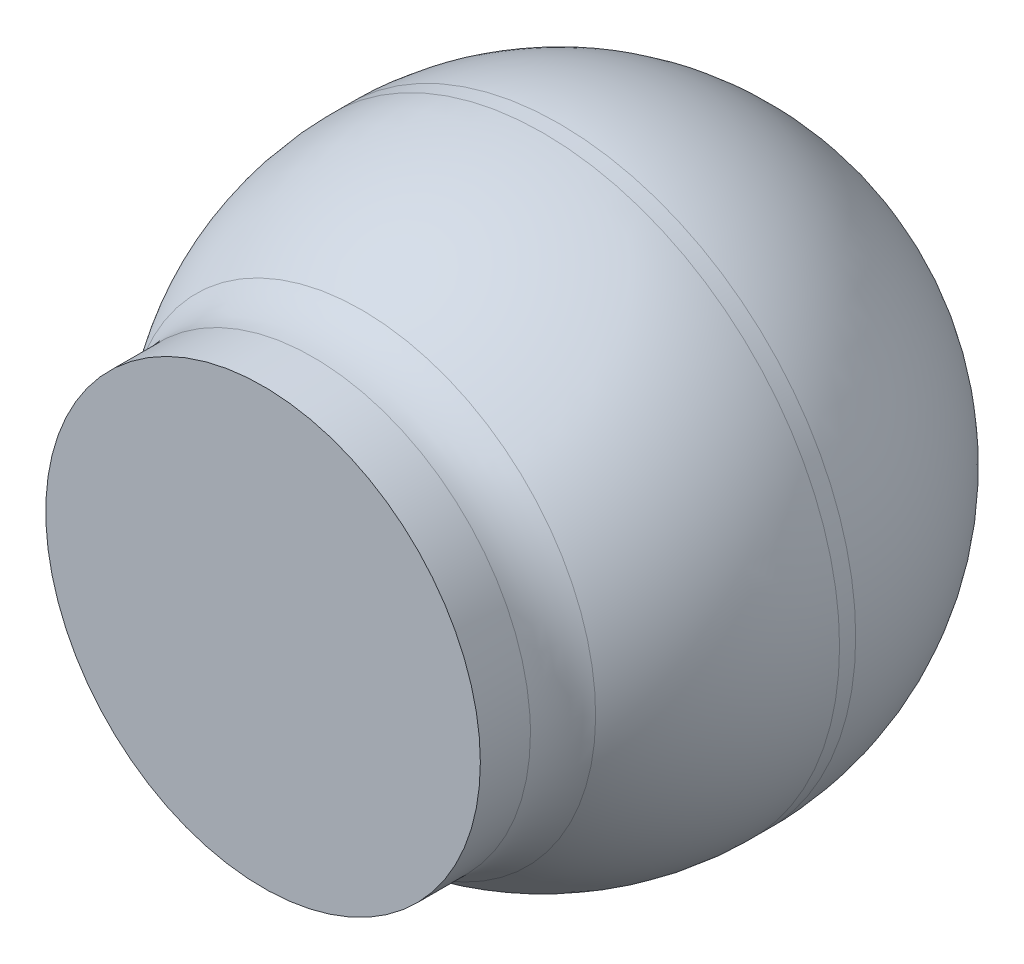
ISO-10303-21;
HEADER;
FILE_DESCRIPTION(('STEP AP214'),'2;1');
FILE_NAME('part.step','',(''),(''),'','','');
FILE_SCHEMA(('AUTOMOTIVE_DESIGN { 1 0 10303 214 1 1 1 1 }'));
ENDSEC;
DATA;
#1=APPLICATION_CONTEXT('core data for automotive mechanical design processes');
#2=APPLICATION_PROTOCOL_DEFINITION('international standard','automotive_design',2000,#1);
#3=PRODUCT_CONTEXT('',#1,'mechanical');
#4=PRODUCT('Part','Part','',(#3));
#5=PRODUCT_RELATED_PRODUCT_CATEGORY('part','',(#4));
#6=PRODUCT_DEFINITION_FORMATION('','',#4);
#7=PRODUCT_DEFINITION_CONTEXT('part definition',#1,'design');
#8=PRODUCT_DEFINITION('design','',#6,#7);
#9=PRODUCT_DEFINITION_SHAPE('','',#8);
#10=(LENGTH_UNIT() NAMED_UNIT(*) SI_UNIT(.MILLI.,.METRE.));
#11=(NAMED_UNIT(*) PLANE_ANGLE_UNIT() SI_UNIT($,.RADIAN.));
#12=(NAMED_UNIT(*) SI_UNIT($,.STERADIAN.) SOLID_ANGLE_UNIT());
#13=UNCERTAINTY_MEASURE_WITH_UNIT(LENGTH_MEASURE(1.E-05),#10,'distance_accuracy_value','');
#14=(GEOMETRIC_REPRESENTATION_CONTEXT(3) GLOBAL_UNCERTAINTY_ASSIGNED_CONTEXT((#13)) GLOBAL_UNIT_ASSIGNED_CONTEXT((#10,
#11,#12)) REPRESENTATION_CONTEXT('',''));
#15=CARTESIAN_POINT('',(0.,0.,0.));
#16=DIRECTION('',(0.,0.,1.));
#17=DIRECTION('',(1.,0.,0.));
#18=AXIS2_PLACEMENT_3D('',#15,#16,#17);
#19=CARTESIAN_POINT('',(-6.912919922269,-2.781349291452,10.006534503384));
#20=DIRECTION('',(0.,0.,-1.));
#21=DIRECTION('',(-1.,0.,0.));
#22=AXIS2_PLACEMENT_3D('',#19,#20,#21);
#23=PLANE('',#22);
#24=CARTESIAN_POINT('',(-6.912919922269,-2.781349291452,10.006534503384));
#25=DIRECTION('',(0.,0.,1.));
#26=DIRECTION('',(1.,0.,0.));
#27=AXIS2_PLACEMENT_3D('',#24,#25,#26);
#28=CIRCLE('',#27,0.275);
#29=CARTESIAN_POINT('',(-6.637919922269,-2.781349291452,10.006534503384));
#30=VERTEX_POINT('',#29);
#31=EDGE_CURVE('E20',#30,#30,#28,.F.);
#32=ORIENTED_EDGE('',*,*,#31,.F.);
#33=EDGE_LOOP('',(#32));
#34=FACE_BOUND('',#33,.T.);
#35=ADVANCED_FACE('F17',(#34),#23,.F.);
#36=CARTESIAN_POINT('',(-6.912919922269,-2.781349291452,9.906534503384));
#37=DIRECTION('',(0.,0.,1.));
#38=DIRECTION('',(1.,0.,0.));
#39=AXIS2_PLACEMENT_3D('',#36,#37,#38);
#40=CYLINDRICAL_SURFACE('',#39,0.275);
#41=CARTESIAN_POINT('',(-6.912919922269,-2.781349291452,9.943180457728));
#42=DIRECTION('',(0.,0.,-1.));
#43=DIRECTION('',(0.996700902337582,0.0811622527992454,0.));
#44=AXIS2_PLACEMENT_3D('',#41,#42,#43);
#45=CIRCLE('',#44,0.275);
#46=CARTESIAN_POINT('',(-6.63882717412617,-2.75902967193221,9.943180457728));
#47=VERTEX_POINT('',#46);
#48=EDGE_CURVE('E65',#47,#47,#45,.F.);
#49=ORIENTED_EDGE('',*,*,#48,.T.);
#50=EDGE_LOOP('',(#49));
#51=FACE_BOUND('',#50,.T.);
#52=ORIENTED_EDGE('',*,*,#31,.T.);
#53=EDGE_LOOP('',(#52));
#54=FACE_BOUND('',#53,.T.);
#55=ADVANCED_FACE('F62',(#51,#54),#40,.T.);
#56=CARTESIAN_POINT('',(-6.912919922269,-2.781349291452,9.943180457728));
#57=DIRECTION('',(0.,0.,-1.));
#58=DIRECTION('',(0.996700902337583,0.081162252799246,0.));
#59=AXIS2_PLACEMENT_3D('',#56,#57,#58);
#60=TOROIDAL_SURFACE('',#59,0.375,0.1);
#61=ORIENTED_EDGE('',*,*,#48,.F.);
#62=EDGE_LOOP('',(#61));
#63=FACE_BOUND('',#62,.T.);
#64=CARTESIAN_POINT('',(-6.912919922269,-2.781349291452,9.881744931236));
#65=DIRECTION('',(0.,0.,-1.));
#66=DIRECTION('',(-0.996700902337598,-0.0811622527990608,0.));
#67=AXIS2_PLACEMENT_3D('',#64,#65,#66);
#68=CIRCLE('',#67,0.296097046412665);
#69=CARTESIAN_POINT('',(-7.208040115608,-2.805381194786,9.881744931236));
#70=VERTEX_POINT('',#69);
#71=EDGE_CURVE('E39',#70,#70,#68,.T.);
#72=ORIENTED_EDGE('',*,*,#71,.F.);
#73=EDGE_LOOP('',(#72));
#74=FACE_BOUND('',#73,.T.);
#75=ADVANCED_FACE('F57',(#63,#74),#60,.F.);
#76=CARTESIAN_POINT('',(-7.286682760645,-2.811785136252,9.651976062157));
#77=CARTESIAN_POINT('',(-7.286682760645,-2.811785136252,9.701461392103));
#78=CARTESIAN_POINT('',(-7.278526217348,-2.811120941579,9.750947004335));
#79=CARTESIAN_POINT('',(-7.262207085349,-2.809792059952,9.798626332798));
#80=CARTESIAN_POINT('',(-7.238341390838,-2.807848654938,9.842699544317));
#81=CARTESIAN_POINT('',(-7.208040115608,-2.805381194786,9.881744931236));
#82=(BOUNDED_CURVE() B_SPLINE_CURVE(5,(#76,#77,#78,#79,#80,#81),.UNSPECIFIED.,.F.,
.F.) B_SPLINE_CURVE_WITH_KNOTS((6,6),(0.,0.661568582165),
.UNSPECIFIED.) CURVE() GEOMETRIC_REPRESENTATION_ITEM() RATIONAL_B_SPLINE_CURVE((1.,1.,1.,1.,1.,1.)) REPRESENTATION_ITEM(''));
#83=CARTESIAN_POINT('',(-6.912919922269,-2.781349291452,9.651976062157));
#84=DIRECTION('',(0.,0.,-1.));
#85=AXIS1_PLACEMENT('',#83,#84);
#86=SURFACE_OF_REVOLUTION('',#82,#85);
#87=CARTESIAN_POINT('',(-6.912919922269,-2.781349291452,9.651976062157));
#88=DIRECTION('',(0.,0.,1.));
#89=DIRECTION('',(1.,0.,0.));
#90=AXIS2_PLACEMENT_3D('',#87,#88,#89);
#91=CIRCLE('',#90,0.375);
#92=CARTESIAN_POINT('',(-6.537919922269,-2.781349291452,9.651976062157));
#93=VERTEX_POINT('',#92);
#94=EDGE_CURVE('E36',#93,#93,#91,.F.);
#95=ORIENTED_EDGE('',*,*,#94,.F.);
#96=EDGE_LOOP('',(#95));
#97=FACE_BOUND('',#96,.T.);
#98=ORIENTED_EDGE('',*,*,#71,.T.);
#99=EDGE_LOOP('',(#98));
#100=FACE_BOUND('',#99,.T.);
#101=ADVANCED_FACE('F53',(#97,#100),#86,.F.);
#102=CARTESIAN_POINT('',(-6.912919922269,-2.781349291452,9.256534503384));
#103=DIRECTION('',(0.,0.,1.));
#104=DIRECTION('',(1.,0.,0.));
#105=AXIS2_PLACEMENT_3D('',#102,#103,#104);
#106=CYLINDRICAL_SURFACE('',#105,0.375);
#107=CARTESIAN_POINT('',(-6.912919922269,-2.781349291452,9.631534503384));
#108=DIRECTION('',(0.,0.,-1.));
#109=DIRECTION('',(0.0811622527992356,-0.996700902337583,0.));
#110=AXIS2_PLACEMENT_3D('',#107,#108,#109);
#111=CIRCLE('',#110,0.375);
#112=CARTESIAN_POINT('',(-6.88248407746929,-3.15511212982859,9.631534503384));
#113=VERTEX_POINT('',#112);
#114=CARTESIAN_POINT('',(-6.94335576706871,-2.40758645307541,9.631534503384));
#115=VERTEX_POINT('',#114);
#116=EDGE_CURVE('E11',#113,#115,#111,.T.);
#117=ORIENTED_EDGE('',*,*,#116,.F.);
#118=CARTESIAN_POINT('',(-6.912919922269,-2.781349291452,9.631534503384));
#119=DIRECTION('',(0.,0.,1.));
#120=DIRECTION('',(0.0811622527992366,-0.996700902337583,0.));
#121=AXIS2_PLACEMENT_3D('',#118,#119,#120);
#122=CIRCLE('',#121,0.375);
#123=EDGE_CURVE('E25',#115,#113,#122,.F.);
#124=ORIENTED_EDGE('',*,*,#123,.F.);
#125=EDGE_LOOP('',(#117,#124));
#126=FACE_BOUND('',#125,.T.);
#127=ORIENTED_EDGE('',*,*,#94,.T.);
#128=EDGE_LOOP('',(#127));
#129=FACE_BOUND('',#128,.T.);
#130=ADVANCED_FACE('F34',(#126,#129),#106,.T.);
#131=CARTESIAN_POINT('',(-6.912919922269,-2.781349291452,9.631534503384));
#132=DIRECTION('',(0.0811622527992361,-0.996700902337583,0.));
#133=DIRECTION('',(-0.996700902337583,-0.0811622527992361,0.));
#134=AXIS2_PLACEMENT_3D('',#131,#132,#133);
#135=SPHERICAL_SURFACE('',#134,0.375);
#136=ORIENTED_EDGE('',*,*,#123,.T.);
#137=ORIENTED_EDGE('',*,*,#116,.T.);
#138=EDGE_LOOP('',(#136,#137));
#139=FACE_BOUND('',#138,.T.);
#140=ADVANCED_FACE('F32',(#139),#135,.T.);
#141=CLOSED_SHELL('',(#35,#55,#75,#101,#130,#140));
#142=MANIFOLD_SOLID_BREP('B1',#141);
#143=ADVANCED_BREP_SHAPE_REPRESENTATION('',(#18,#142),#14);
#144=SHAPE_DEFINITION_REPRESENTATION(#9,#143);
ENDSEC;
END-ISO-10303-21;
